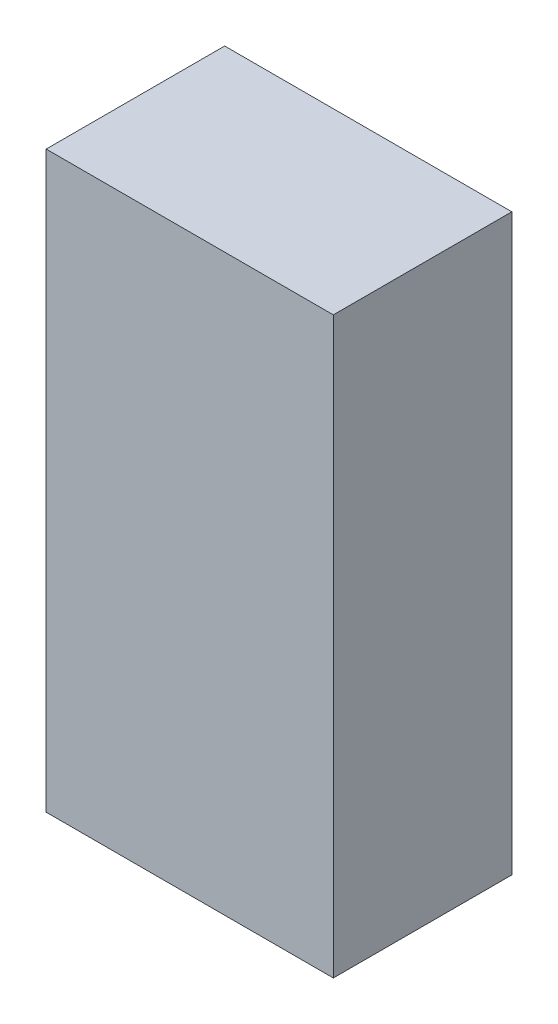
ISO-10303-21;
HEADER;
FILE_DESCRIPTION(('STEP AP214'),'2;1');
FILE_NAME('part.step','',(''),(''),'','','');
FILE_SCHEMA(('AUTOMOTIVE_DESIGN { 1 0 10303 214 1 1 1 1 }'));
ENDSEC;
DATA;
#1=APPLICATION_CONTEXT('core data for automotive mechanical design processes');
#2=APPLICATION_PROTOCOL_DEFINITION('international standard','automotive_design',2000,#1);
#3=PRODUCT_CONTEXT('',#1,'mechanical');
#4=PRODUCT('Part','Part','',(#3));
#5=PRODUCT_RELATED_PRODUCT_CATEGORY('part','',(#4));
#6=PRODUCT_DEFINITION_FORMATION('','',#4);
#7=PRODUCT_DEFINITION_CONTEXT('part definition',#1,'design');
#8=PRODUCT_DEFINITION('design','',#6,#7);
#9=PRODUCT_DEFINITION_SHAPE('','',#8);
#10=(LENGTH_UNIT() NAMED_UNIT(*) SI_UNIT(.MILLI.,.METRE.));
#11=(NAMED_UNIT(*) PLANE_ANGLE_UNIT() SI_UNIT($,.RADIAN.));
#12=(NAMED_UNIT(*) SI_UNIT($,.STERADIAN.) SOLID_ANGLE_UNIT());
#13=UNCERTAINTY_MEASURE_WITH_UNIT(LENGTH_MEASURE(1.E-05),#10,'distance_accuracy_value','');
#14=(GEOMETRIC_REPRESENTATION_CONTEXT(3) GLOBAL_UNCERTAINTY_ASSIGNED_CONTEXT((#13)) GLOBAL_UNIT_ASSIGNED_CONTEXT((#10,
#11,#12)) REPRESENTATION_CONTEXT('',''));
#15=CARTESIAN_POINT('',(0.,0.,0.));
#16=DIRECTION('',(0.,0.,1.));
#17=DIRECTION('',(1.,0.,0.));
#18=AXIS2_PLACEMENT_3D('',#15,#16,#17);
#19=CARTESIAN_POINT('',(2.413,2.286,5.));
#20=DIRECTION('',(0.,0.,-1.));
#21=DIRECTION('',(-1.,0.,0.));
#22=AXIS2_PLACEMENT_3D('',#19,#20,#21);
#23=PLANE('',#22);
#24=DIRECTION('',(0.,1.,0.));
#25=VECTOR('',#24,1.);
#26=CARTESIAN_POINT('',(-2.413,2.286,5.));
#27=LINE('',#26,#25);
#28=CARTESIAN_POINT('',(-2.413,2.286,5.));
#29=VERTEX_POINT('',#28);
#30=CARTESIAN_POINT('',(-2.413,-7.366,5.));
#31=VERTEX_POINT('',#30);
#32=EDGE_CURVE('E55',#29,#31,#27,.F.);
#33=ORIENTED_EDGE('',*,*,#32,.T.);
#34=DIRECTION('',(1.,0.,0.));
#35=VECTOR('',#34,1.);
#36=CARTESIAN_POINT('',(-2.413,-7.366,5.));
#37=LINE('',#36,#35);
#38=CARTESIAN_POINT('',(2.413,-7.366,5.));
#39=VERTEX_POINT('',#38);
#40=EDGE_CURVE('E57',#31,#39,#37,.T.);
#41=ORIENTED_EDGE('',*,*,#40,.T.);
#42=DIRECTION('',(0.,1.,0.));
#43=VECTOR('',#42,1.);
#44=CARTESIAN_POINT('',(2.413,-7.366,5.));
#45=LINE('',#44,#43);
#46=CARTESIAN_POINT('',(2.413,2.286,5.));
#47=VERTEX_POINT('',#46);
#48=EDGE_CURVE('E20',#39,#47,#45,.T.);
#49=ORIENTED_EDGE('',*,*,#48,.T.);
#50=DIRECTION('',(1.,0.,0.));
#51=VECTOR('',#50,1.);
#52=CARTESIAN_POINT('',(2.413,2.286,5.));
#53=LINE('',#52,#51);
#54=EDGE_CURVE('E80',#47,#29,#53,.F.);
#55=ORIENTED_EDGE('',*,*,#54,.T.);
#56=EDGE_LOOP('',(#33,#41,#49,#55));
#57=FACE_BOUND('',#56,.T.);
#58=ADVANCED_FACE('F17',(#57),#23,.F.);
#59=CARTESIAN_POINT('',(2.413,-7.366,2.));
#60=DIRECTION('',(-1.,0.,0.));
#61=DIRECTION('',(0.,0.,1.));
#62=AXIS2_PLACEMENT_3D('',#59,#60,#61);
#63=PLANE('',#62);
#64=DIRECTION('',(0.,0.,-1.));
#65=VECTOR('',#64,1.);
#66=CARTESIAN_POINT('',(2.413,2.286,2.));
#67=LINE('',#66,#65);
#68=CARTESIAN_POINT('',(2.413,2.286,2.));
#69=VERTEX_POINT('',#68);
#70=EDGE_CURVE('E68',#69,#47,#67,.F.);
#71=ORIENTED_EDGE('',*,*,#70,.T.);
#72=ORIENTED_EDGE('',*,*,#48,.F.);
#73=DIRECTION('',(0.,0.,1.));
#74=VECTOR('',#73,1.);
#75=CARTESIAN_POINT('',(2.413,-7.366,2.));
#76=LINE('',#75,#74);
#77=CARTESIAN_POINT('',(2.413,-7.366,2.));
#78=VERTEX_POINT('',#77);
#79=EDGE_CURVE('E63',#39,#78,#76,.F.);
#80=ORIENTED_EDGE('',*,*,#79,.T.);
#81=DIRECTION('',(0.,1.,0.));
#82=VECTOR('',#81,1.);
#83=CARTESIAN_POINT('',(2.413,2.286,2.));
#84=LINE('',#83,#82);
#85=EDGE_CURVE('E83',#69,#78,#84,.F.);
#86=ORIENTED_EDGE('',*,*,#85,.F.);
#87=EDGE_LOOP('',(#71,#72,#80,#86));
#88=FACE_BOUND('',#87,.T.);
#89=ADVANCED_FACE('F65',(#88),#63,.F.);
#90=CARTESIAN_POINT('',(-2.413,-7.366,2.));
#91=DIRECTION('',(0.,1.,0.));
#92=DIRECTION('',(0.,0.,1.));
#93=AXIS2_PLACEMENT_3D('',#90,#91,#92);
#94=PLANE('',#93);
#95=ORIENTED_EDGE('',*,*,#79,.F.);
#96=ORIENTED_EDGE('',*,*,#40,.F.);
#97=DIRECTION('',(0.,0.,-1.));
#98=VECTOR('',#97,1.);
#99=CARTESIAN_POINT('',(-2.413,-7.366,2.));
#100=LINE('',#99,#98);
#101=CARTESIAN_POINT('',(-2.413,-7.366,2.));
#102=VERTEX_POINT('',#101);
#103=EDGE_CURVE('E75',#31,#102,#100,.T.);
#104=ORIENTED_EDGE('',*,*,#103,.T.);
#105=DIRECTION('',(-1.,0.,0.));
#106=VECTOR('',#105,1.);
#107=CARTESIAN_POINT('',(2.413,-7.366,2.));
#108=LINE('',#107,#106);
#109=EDGE_CURVE('E72',#78,#102,#108,.T.);
#110=ORIENTED_EDGE('',*,*,#109,.F.);
#111=EDGE_LOOP('',(#95,#96,#104,#110));
#112=FACE_BOUND('',#111,.T.);
#113=ADVANCED_FACE('F70',(#112),#94,.F.);
#114=CARTESIAN_POINT('',(-2.413,2.286,2.));
#115=DIRECTION('',(1.,0.,0.));
#116=DIRECTION('',(0.,0.,-1.));
#117=AXIS2_PLACEMENT_3D('',#114,#115,#116);
#118=PLANE('',#117);
#119=ORIENTED_EDGE('',*,*,#103,.F.);
#120=ORIENTED_EDGE('',*,*,#32,.F.);
#121=DIRECTION('',(0.,0.,-1.));
#122=VECTOR('',#121,1.);
#123=CARTESIAN_POINT('',(-2.413,2.286,2.));
#124=LINE('',#123,#122);
#125=CARTESIAN_POINT('',(-2.413,2.286,2.));
#126=VERTEX_POINT('',#125);
#127=EDGE_CURVE('E35',#29,#126,#124,.T.);
#128=ORIENTED_EDGE('',*,*,#127,.T.);
#129=DIRECTION('',(0.,1.,0.));
#130=VECTOR('',#129,1.);
#131=CARTESIAN_POINT('',(-2.413,2.286,2.));
#132=LINE('',#131,#130);
#133=EDGE_CURVE('E26',#102,#126,#132,.T.);
#134=ORIENTED_EDGE('',*,*,#133,.F.);
#135=EDGE_LOOP('',(#119,#120,#128,#134));
#136=FACE_BOUND('',#135,.T.);
#137=ADVANCED_FACE('F89',(#136),#118,.F.);
#138=CARTESIAN_POINT('',(2.413,2.286,2.));
#139=DIRECTION('',(0.,-1.,0.));
#140=DIRECTION('',(0.,0.,-1.));
#141=AXIS2_PLACEMENT_3D('',#138,#139,#140);
#142=PLANE('',#141);
#143=ORIENTED_EDGE('',*,*,#127,.F.);
#144=ORIENTED_EDGE('',*,*,#54,.F.);
#145=ORIENTED_EDGE('',*,*,#70,.F.);
#146=DIRECTION('',(-1.,0.,0.));
#147=VECTOR('',#146,1.);
#148=CARTESIAN_POINT('',(2.413,2.286,2.));
#149=LINE('',#148,#147);
#150=EDGE_CURVE('E11',#126,#69,#149,.F.);
#151=ORIENTED_EDGE('',*,*,#150,.F.);
#152=EDGE_LOOP('',(#143,#144,#145,#151));
#153=FACE_BOUND('',#152,.T.);
#154=ADVANCED_FACE('F91',(#153),#142,.F.);
#155=CARTESIAN_POINT('',(2.413,2.286,2.));
#156=DIRECTION('',(0.,0.,-1.));
#157=DIRECTION('',(-1.,0.,0.));
#158=AXIS2_PLACEMENT_3D('',#155,#156,#157);
#159=PLANE('',#158);
#160=ORIENTED_EDGE('',*,*,#133,.T.);
#161=ORIENTED_EDGE('',*,*,#150,.T.);
#162=ORIENTED_EDGE('',*,*,#85,.T.);
#163=ORIENTED_EDGE('',*,*,#109,.T.);
#164=EDGE_LOOP('',(#160,#161,#162,#163));
#165=FACE_BOUND('',#164,.T.);
#166=ADVANCED_FACE('F88',(#165),#159,.T.);
#167=CLOSED_SHELL('',(#58,#89,#113,#137,#154,#166));
#168=MANIFOLD_SOLID_BREP('B1',#167);
#169=ADVANCED_BREP_SHAPE_REPRESENTATION('',(#18,#168),#14);
#170=SHAPE_DEFINITION_REPRESENTATION(#9,#169);
ENDSEC;
END-ISO-10303-21;
